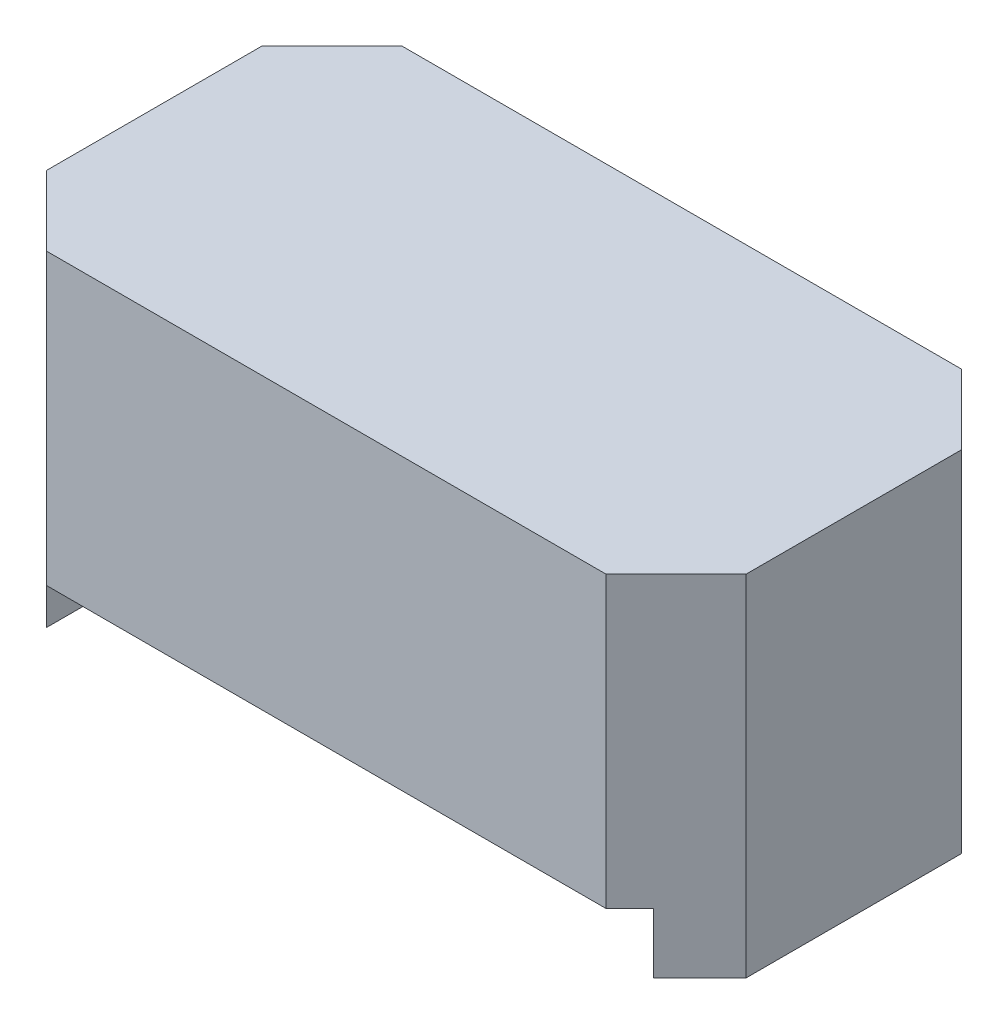
ISO-10303-21;
HEADER;
FILE_DESCRIPTION(('STEP AP214'),'2;1');
FILE_NAME('part.step','',(''),(''),'','','');
FILE_SCHEMA(('AUTOMOTIVE_DESIGN { 1 0 10303 214 1 1 1 1 }'));
ENDSEC;
DATA;
#1=APPLICATION_CONTEXT('core data for automotive mechanical design processes');
#2=APPLICATION_PROTOCOL_DEFINITION('international standard','automotive_design',2000,#1);
#3=PRODUCT_CONTEXT('',#1,'mechanical');
#4=PRODUCT('Part','Part','',(#3));
#5=PRODUCT_RELATED_PRODUCT_CATEGORY('part','',(#4));
#6=PRODUCT_DEFINITION_FORMATION('','',#4);
#7=PRODUCT_DEFINITION_CONTEXT('part definition',#1,'design');
#8=PRODUCT_DEFINITION('design','',#6,#7);
#9=PRODUCT_DEFINITION_SHAPE('','',#8);
#10=(LENGTH_UNIT() NAMED_UNIT(*) SI_UNIT(.MILLI.,.METRE.));
#11=(NAMED_UNIT(*) PLANE_ANGLE_UNIT() SI_UNIT($,.RADIAN.));
#12=(NAMED_UNIT(*) SI_UNIT($,.STERADIAN.) SOLID_ANGLE_UNIT());
#13=UNCERTAINTY_MEASURE_WITH_UNIT(LENGTH_MEASURE(1.E-05),#10,'distance_accuracy_value','');
#14=(GEOMETRIC_REPRESENTATION_CONTEXT(3) GLOBAL_UNCERTAINTY_ASSIGNED_CONTEXT((#13)) GLOBAL_UNIT_ASSIGNED_CONTEXT((#10,
#11,#12)) REPRESENTATION_CONTEXT('',''));
#15=CARTESIAN_POINT('',(0.,0.,0.));
#16=DIRECTION('',(0.,0.,1.));
#17=DIRECTION('',(1.,0.,0.));
#18=AXIS2_PLACEMENT_3D('',#15,#16,#17);
#19=CARTESIAN_POINT('',(0.,0.,0.));
#20=DIRECTION('',(0.,1.,0.));
#21=DIRECTION('',(0.,0.,1.));
#22=AXIS2_PLACEMENT_3D('',#19,#20,#21);
#23=PLANE('',#22);
#24=DIRECTION('',(0.,0.,1.));
#25=VECTOR('',#24,1.);
#26=CARTESIAN_POINT('',(-0.939961560158189,0.,-3.5));
#27=LINE('',#26,#25);
#28=CARTESIAN_POINT('',(-0.939961560158189,0.,-2.37003843984181));
#29=VERTEX_POINT('',#28);
#30=CARTESIAN_POINT('',(-0.939961560158189,0.,-0.169961560158188));
#31=VERTEX_POINT('',#30);
#32=EDGE_CURVE('E125',#29,#31,#27,.T.);
#33=ORIENTED_EDGE('',*,*,#32,.T.);
#34=DIRECTION('',(0.707106781186547,0.,0.707106781186548));
#35=VECTOR('',#34,1.);
#36=CARTESIAN_POINT('',(-1.27,0.,-0.500000000000001));
#37=LINE('',#36,#35);
#38=CARTESIAN_POINT('',(-1.27,0.,-0.5));
#39=VERTEX_POINT('',#38);
#40=EDGE_CURVE('E115',#39,#31,#37,.T.);
#41=ORIENTED_EDGE('',*,*,#40,.F.);
#42=DIRECTION('',(0.,0.,1.));
#43=VECTOR('',#42,1.);
#44=CARTESIAN_POINT('',(-1.27,0.,0.));
#45=LINE('',#44,#43);
#46=CARTESIAN_POINT('',(-1.27,0.,-2.04));
#47=VERTEX_POINT('',#46);
#48=EDGE_CURVE('E19',#47,#39,#45,.T.);
#49=ORIENTED_EDGE('',*,*,#48,.F.);
#50=DIRECTION('',(-0.707106781186548,0.,0.707106781186547));
#51=VECTOR('',#50,1.);
#52=CARTESIAN_POINT('',(-0.939961560158189,0.,-2.37003843984181));
#53=LINE('',#52,#51);
#54=EDGE_CURVE('E101',#29,#47,#53,.T.);
#55=ORIENTED_EDGE('',*,*,#54,.F.);
#56=EDGE_LOOP('',(#33,#41,#49,#55));
#57=FACE_BOUND('',#56,.T.);
#58=ADVANCED_FACE('F16',(#57),#23,.F.);
#59=CARTESIAN_POINT('',(0.,0.,0.));
#60=DIRECTION('',(0.,1.,0.));
#61=DIRECTION('',(0.,0.,1.));
#62=AXIS2_PLACEMENT_3D('',#59,#60,#61);
#63=PLANE('',#62);
#64=DIRECTION('',(0.,0.,1.));
#65=VECTOR('',#64,1.);
#66=CARTESIAN_POINT('',(3.39996156015819,0.,-3.5));
#67=LINE('',#66,#65);
#68=CARTESIAN_POINT('',(3.39996156015819,0.,-0.169961560158188));
#69=VERTEX_POINT('',#68);
#70=CARTESIAN_POINT('',(3.39996156015819,0.,-2.37003843984181));
#71=VERTEX_POINT('',#70);
#72=EDGE_CURVE('E141',#69,#71,#67,.F.);
#73=ORIENTED_EDGE('',*,*,#72,.T.);
#74=DIRECTION('',(-0.707106781186547,0.,-0.707106781186547));
#75=VECTOR('',#74,1.);
#76=CARTESIAN_POINT('',(3.73,0.,-2.04));
#77=LINE('',#76,#75);
#78=CARTESIAN_POINT('',(3.73,0.,-2.04));
#79=VERTEX_POINT('',#78);
#80=EDGE_CURVE('E127',#79,#71,#77,.T.);
#81=ORIENTED_EDGE('',*,*,#80,.F.);
#82=DIRECTION('',(0.,0.,1.));
#83=VECTOR('',#82,1.);
#84=CARTESIAN_POINT('',(3.73,0.,0.));
#85=LINE('',#84,#83);
#86=CARTESIAN_POINT('',(3.73,0.,-0.500000000000001));
#87=VERTEX_POINT('',#86);
#88=EDGE_CURVE('E135',#79,#87,#85,.T.);
#89=ORIENTED_EDGE('',*,*,#88,.T.);
#90=DIRECTION('',(0.707106781186549,0.,-0.707106781186546));
#91=VECTOR('',#90,1.);
#92=CARTESIAN_POINT('',(3.39996156015819,0.,-0.169961560158188));
#93=LINE('',#92,#91);
#94=EDGE_CURVE('E131',#69,#87,#93,.T.);
#95=ORIENTED_EDGE('',*,*,#94,.F.);
#96=EDGE_LOOP('',(#73,#81,#89,#95));
#97=FACE_BOUND('',#96,.T.);
#98=ADVANCED_FACE('F227',(#97),#63,.F.);
#99=CARTESIAN_POINT('',(3.73,2.5,0.));
#100=DIRECTION('',(-1.,0.,0.));
#101=DIRECTION('',(0.,0.,1.));
#102=AXIS2_PLACEMENT_3D('',#99,#100,#101);
#103=PLANE('',#102);
#104=DIRECTION('',(0.,1.,0.));
#105=VECTOR('',#104,1.);
#106=CARTESIAN_POINT('',(3.73,2.5,-2.04));
#107=LINE('',#106,#105);
#108=CARTESIAN_POINT('',(3.73,2.5,-2.04));
#109=VERTEX_POINT('',#108);
#110=EDGE_CURVE('E151',#79,#109,#107,.T.);
#111=ORIENTED_EDGE('',*,*,#110,.T.);
#112=DIRECTION('',(0.,0.,1.));
#113=VECTOR('',#112,1.);
#114=CARTESIAN_POINT('',(3.73,2.5,0.));
#115=LINE('',#114,#113);
#116=CARTESIAN_POINT('',(3.73,2.5,-0.500000000000001));
#117=VERTEX_POINT('',#116);
#118=EDGE_CURVE('E133',#117,#109,#115,.F.);
#119=ORIENTED_EDGE('',*,*,#118,.F.);
#120=DIRECTION('',(0.,1.,0.));
#121=VECTOR('',#120,1.);
#122=CARTESIAN_POINT('',(3.73,2.5,-0.500000000000001));
#123=LINE('',#122,#121);
#124=EDGE_CURVE('E160',#117,#87,#123,.F.);
#125=ORIENTED_EDGE('',*,*,#124,.T.);
#126=ORIENTED_EDGE('',*,*,#88,.F.);
#127=EDGE_LOOP('',(#111,#119,#125,#126));
#128=FACE_BOUND('',#127,.T.);
#129=ADVANCED_FACE('F220',(#128),#103,.F.);
#130=CARTESIAN_POINT('',(-0.939961560158189,-0.767799621488547,-3.5));
#131=DIRECTION('',(-1.,0.,0.));
#132=DIRECTION('',(0.,0.,1.));
#133=AXIS2_PLACEMENT_3D('',#130,#131,#132);
#134=PLANE('',#133);
#135=DIRECTION('',(0.,0.,1.));
#136=VECTOR('',#135,1.);
#137=CARTESIAN_POINT('',(-0.939961560158189,0.429778984675444,-3.5));
#138=LINE('',#137,#136);
#139=CARTESIAN_POINT('',(-0.939961560158189,0.429778984675444,-2.37003843984181));
#140=VERTEX_POINT('',#139);
#141=CARTESIAN_POINT('',(-0.939961560158189,0.429778984675444,-0.169961560158189));
#142=VERTEX_POINT('',#141);
#143=EDGE_CURVE('E165',#140,#142,#138,.T.);
#144=ORIENTED_EDGE('',*,*,#143,.T.);
#145=DIRECTION('',(0.,1.,0.));
#146=VECTOR('',#145,1.);
#147=CARTESIAN_POINT('',(-0.939961560158189,-0.767799621488547,-0.169961560158188));
#148=LINE('',#147,#146);
#149=EDGE_CURVE('E139',#31,#142,#148,.T.);
#150=ORIENTED_EDGE('',*,*,#149,.F.);
#151=ORIENTED_EDGE('',*,*,#32,.F.);
#152=DIRECTION('',(0.,1.,0.));
#153=VECTOR('',#152,1.);
#154=CARTESIAN_POINT('',(-0.939961560158189,2.5,-2.37003843984181));
#155=LINE('',#154,#153);
#156=EDGE_CURVE('E149',#29,#140,#155,.T.);
#157=ORIENTED_EDGE('',*,*,#156,.T.);
#158=EDGE_LOOP('',(#144,#150,#151,#157));
#159=FACE_BOUND('',#158,.T.);
#160=ADVANCED_FACE('F212',(#159),#134,.F.);
#161=CARTESIAN_POINT('',(3.39996156015818,-0.767799621488547,-3.5));
#162=DIRECTION('',(1.,0.,0.));
#163=DIRECTION('',(0.,1.,0.));
#164=AXIS2_PLACEMENT_3D('',#161,#162,#163);
#165=PLANE('',#164);
#166=ORIENTED_EDGE('',*,*,#72,.F.);
#167=DIRECTION('',(0.,1.,0.));
#168=VECTOR('',#167,1.);
#169=CARTESIAN_POINT('',(3.39996156015819,2.5,-0.169961560158187));
#170=LINE('',#169,#168);
#171=CARTESIAN_POINT('',(3.39996156015819,0.429778984675444,-0.169961560158188));
#172=VERTEX_POINT('',#171);
#173=EDGE_CURVE('E163',#69,#172,#170,.T.);
#174=ORIENTED_EDGE('',*,*,#173,.T.);
#175=DIRECTION('',(0.,0.,1.));
#176=VECTOR('',#175,1.);
#177=CARTESIAN_POINT('',(3.39996156015818,0.429778984675444,-3.5));
#178=LINE('',#177,#176);
#179=CARTESIAN_POINT('',(3.39996156015819,0.429778984675444,-2.37003843984181));
#180=VERTEX_POINT('',#179);
#181=EDGE_CURVE('E171',#172,#180,#178,.F.);
#182=ORIENTED_EDGE('',*,*,#181,.T.);
#183=DIRECTION('',(0.,1.,0.));
#184=VECTOR('',#183,1.);
#185=CARTESIAN_POINT('',(3.39996156015819,2.5,-2.37003843984182));
#186=LINE('',#185,#184);
#187=EDGE_CURVE('E156',#180,#71,#186,.F.);
#188=ORIENTED_EDGE('',*,*,#187,.T.);
#189=EDGE_LOOP('',(#166,#174,#182,#188));
#190=FACE_BOUND('',#189,.T.);
#191=ADVANCED_FACE('F234',(#190),#165,.F.);
#192=CARTESIAN_POINT('',(-1.27,2.5,0.));
#193=DIRECTION('',(1.,0.,0.));
#194=DIRECTION('',(0.,0.,-1.));
#195=AXIS2_PLACEMENT_3D('',#192,#193,#194);
#196=PLANE('',#195);
#197=DIRECTION('',(0.,1.,0.));
#198=VECTOR('',#197,1.);
#199=CARTESIAN_POINT('',(-1.27,2.5,-2.04));
#200=LINE('',#199,#198);
#201=CARTESIAN_POINT('',(-1.27,2.5,-2.04));
#202=VERTEX_POINT('',#201);
#203=EDGE_CURVE('E112',#202,#47,#200,.F.);
#204=ORIENTED_EDGE('',*,*,#203,.T.);
#205=ORIENTED_EDGE('',*,*,#48,.T.);
#206=DIRECTION('',(0.,1.,0.));
#207=VECTOR('',#206,1.);
#208=CARTESIAN_POINT('',(-1.27,2.5,-0.500000000000001));
#209=LINE('',#208,#207);
#210=CARTESIAN_POINT('',(-1.27,2.5,-0.5));
#211=VERTEX_POINT('',#210);
#212=EDGE_CURVE('E110',#39,#211,#209,.T.);
#213=ORIENTED_EDGE('',*,*,#212,.T.);
#214=DIRECTION('',(0.,0.,-1.));
#215=VECTOR('',#214,1.);
#216=CARTESIAN_POINT('',(-1.27,2.5,0.));
#217=LINE('',#216,#215);
#218=EDGE_CURVE('E144',#202,#211,#217,.F.);
#219=ORIENTED_EDGE('',*,*,#218,.F.);
#220=EDGE_LOOP('',(#204,#205,#213,#219));
#221=FACE_BOUND('',#220,.T.);
#222=ADVANCED_FACE('F108',(#221),#196,.F.);
#223=CARTESIAN_POINT('',(-1.27,2.5,-2.04));
#224=DIRECTION('',(0.707106781186546,0.,0.707106781186549));
#225=DIRECTION('',(0.707106781186549,0.,-0.707106781186546));
#226=AXIS2_PLACEMENT_3D('',#223,#224,#225);
#227=PLANE('',#226);
#228=ORIENTED_EDGE('',*,*,#54,.T.);
#229=ORIENTED_EDGE('',*,*,#203,.F.);
#230=DIRECTION('',(0.707106781186549,0.,-0.707106781186546));
#231=VECTOR('',#230,1.);
#232=CARTESIAN_POINT('',(-1.27,2.5,-2.04));
#233=LINE('',#232,#231);
#234=CARTESIAN_POINT('',(-0.769999999999997,2.5,-2.54));
#235=VERTEX_POINT('',#234);
#236=EDGE_CURVE('E146',#235,#202,#233,.F.);
#237=ORIENTED_EDGE('',*,*,#236,.F.);
#238=DIRECTION('',(0.,1.,0.));
#239=VECTOR('',#238,1.);
#240=CARTESIAN_POINT('',(-0.769999999999996,2.5,-2.54));
#241=LINE('',#240,#239);
#242=CARTESIAN_POINT('',(-0.769999999999997,0.429778984675444,-2.54));
#243=VERTEX_POINT('',#242);
#244=EDGE_CURVE('E181',#235,#243,#241,.F.);
#245=ORIENTED_EDGE('',*,*,#244,.T.);
#246=DIRECTION('',(-0.70710678118655,0.,0.707106781186545));
#247=VECTOR('',#246,1.);
#248=CARTESIAN_POINT('',(-0.769999999999998,0.429778984675444,-2.54));
#249=LINE('',#248,#247);
#250=EDGE_CURVE('E122',#243,#140,#249,.T.);
#251=ORIENTED_EDGE('',*,*,#250,.T.);
#252=ORIENTED_EDGE('',*,*,#156,.F.);
#253=EDGE_LOOP('',(#228,#229,#237,#245,#251,#252));
#254=FACE_BOUND('',#253,.T.);
#255=ADVANCED_FACE('F206',(#254),#227,.F.);
#256=CARTESIAN_POINT('',(3.23,2.5,-2.54));
#257=DIRECTION('',(-0.707106781186548,0.,0.707106781186547));
#258=DIRECTION('',(0.707106781186547,0.,0.707106781186548));
#259=AXIS2_PLACEMENT_3D('',#256,#257,#258);
#260=PLANE('',#259);
#261=DIRECTION('',(-0.707106781186545,0.,-0.70710678118655));
#262=VECTOR('',#261,1.);
#263=CARTESIAN_POINT('',(3.39996156015818,0.429778984675444,-2.37003843984181));
#264=LINE('',#263,#262);
#265=CARTESIAN_POINT('',(3.23,0.429778984675444,-2.54));
#266=VERTEX_POINT('',#265);
#267=EDGE_CURVE('E173',#180,#266,#264,.T.);
#268=ORIENTED_EDGE('',*,*,#267,.T.);
#269=DIRECTION('',(0.,1.,0.));
#270=VECTOR('',#269,1.);
#271=CARTESIAN_POINT('',(3.23,2.5,-2.54));
#272=LINE('',#271,#270);
#273=CARTESIAN_POINT('',(3.23,2.5,-2.54));
#274=VERTEX_POINT('',#273);
#275=EDGE_CURVE('E186',#266,#274,#272,.T.);
#276=ORIENTED_EDGE('',*,*,#275,.T.);
#277=DIRECTION('',(0.707106781186547,0.,0.707106781186548));
#278=VECTOR('',#277,1.);
#279=CARTESIAN_POINT('',(3.23,2.5,-2.54));
#280=LINE('',#279,#278);
#281=EDGE_CURVE('E154',#109,#274,#280,.F.);
#282=ORIENTED_EDGE('',*,*,#281,.F.);
#283=ORIENTED_EDGE('',*,*,#110,.F.);
#284=ORIENTED_EDGE('',*,*,#80,.T.);
#285=ORIENTED_EDGE('',*,*,#187,.F.);
#286=EDGE_LOOP('',(#268,#276,#282,#283,#284,#285));
#287=FACE_BOUND('',#286,.T.);
#288=ADVANCED_FACE('F229',(#287),#260,.F.);
#289=CARTESIAN_POINT('',(3.73,2.5,-0.500000000000001));
#290=DIRECTION('',(-0.707106781186546,0.,-0.707106781186549));
#291=DIRECTION('',(-0.707106781186549,0.,0.707106781186546));
#292=AXIS2_PLACEMENT_3D('',#289,#290,#291);
#293=PLANE('',#292);
#294=ORIENTED_EDGE('',*,*,#94,.T.);
#295=ORIENTED_EDGE('',*,*,#124,.F.);
#296=DIRECTION('',(-0.707106781186549,0.,0.707106781186546));
#297=VECTOR('',#296,1.);
#298=CARTESIAN_POINT('',(3.73,2.5,-0.500000000000001));
#299=LINE('',#298,#297);
#300=CARTESIAN_POINT('',(3.23,2.5,0.));
#301=VERTEX_POINT('',#300);
#302=EDGE_CURVE('E34',#301,#117,#299,.F.);
#303=ORIENTED_EDGE('',*,*,#302,.F.);
#304=DIRECTION('',(0.,1.,0.));
#305=VECTOR('',#304,1.);
#306=CARTESIAN_POINT('',(3.23,2.5,0.));
#307=LINE('',#306,#305);
#308=CARTESIAN_POINT('',(3.23,0.429778984675444,0.));
#309=VERTEX_POINT('',#308);
#310=EDGE_CURVE('E189',#301,#309,#307,.F.);
#311=ORIENTED_EDGE('',*,*,#310,.T.);
#312=DIRECTION('',(0.707106781186547,0.,-0.707106781186548));
#313=VECTOR('',#312,1.);
#314=CARTESIAN_POINT('',(3.23,0.429778984675444,0.));
#315=LINE('',#314,#313);
#316=EDGE_CURVE('E168',#309,#172,#315,.T.);
#317=ORIENTED_EDGE('',*,*,#316,.T.);
#318=ORIENTED_EDGE('',*,*,#173,.F.);
#319=EDGE_LOOP('',(#294,#295,#303,#311,#317,#318));
#320=FACE_BOUND('',#319,.T.);
#321=ADVANCED_FACE('F223',(#320),#293,.F.);
#322=CARTESIAN_POINT('',(-0.939961560158189,0.429778984675444,-3.5));
#323=DIRECTION('',(0.,1.,0.));
#324=DIRECTION('',(0.,0.,1.));
#325=AXIS2_PLACEMENT_3D('',#322,#323,#324);
#326=PLANE('',#325);
#327=DIRECTION('',(1.,0.,0.));
#328=VECTOR('',#327,1.);
#329=CARTESIAN_POINT('',(3.73,0.429778984675444,-2.54));
#330=LINE('',#329,#328);
#331=EDGE_CURVE('E183',#243,#266,#330,.T.);
#332=ORIENTED_EDGE('',*,*,#331,.T.);
#333=ORIENTED_EDGE('',*,*,#267,.F.);
#334=ORIENTED_EDGE('',*,*,#181,.F.);
#335=ORIENTED_EDGE('',*,*,#316,.F.);
#336=DIRECTION('',(-1.,0.,0.));
#337=VECTOR('',#336,1.);
#338=CARTESIAN_POINT('',(3.73,0.429778984675444,0.));
#339=LINE('',#338,#337);
#340=CARTESIAN_POINT('',(-0.770000000000001,0.429778984675444,0.));
#341=VERTEX_POINT('',#340);
#342=EDGE_CURVE('E191',#309,#341,#339,.T.);
#343=ORIENTED_EDGE('',*,*,#342,.T.);
#344=DIRECTION('',(-0.707106781186547,0.,-0.707106781186548));
#345=VECTOR('',#344,1.);
#346=CARTESIAN_POINT('',(-0.770000000000001,0.429778984675444,0.));
#347=LINE('',#346,#345);
#348=EDGE_CURVE('E178',#341,#142,#347,.T.);
#349=ORIENTED_EDGE('',*,*,#348,.T.);
#350=ORIENTED_EDGE('',*,*,#143,.F.);
#351=ORIENTED_EDGE('',*,*,#250,.F.);
#352=EDGE_LOOP('',(#332,#333,#334,#335,#343,#349,#350,#351));
#353=FACE_BOUND('',#352,.T.);
#354=ADVANCED_FACE('F209',(#353),#326,.F.);
#355=CARTESIAN_POINT('',(-0.770000000000001,2.5,0.));
#356=DIRECTION('',(0.707106781186548,0.,-0.707106781186547));
#357=DIRECTION('',(-0.707106781186547,0.,-0.707106781186548));
#358=AXIS2_PLACEMENT_3D('',#355,#356,#357);
#359=PLANE('',#358);
#360=ORIENTED_EDGE('',*,*,#348,.F.);
#361=DIRECTION('',(0.,1.,0.));
#362=VECTOR('',#361,1.);
#363=CARTESIAN_POINT('',(-0.77,2.5,0.));
#364=LINE('',#363,#362);
#365=CARTESIAN_POINT('',(-0.770000000000001,2.5,0.));
#366=VERTEX_POINT('',#365);
#367=EDGE_CURVE('E193',#341,#366,#364,.T.);
#368=ORIENTED_EDGE('',*,*,#367,.T.);
#369=DIRECTION('',(-0.707106781186547,0.,-0.707106781186548));
#370=VECTOR('',#369,1.);
#371=CARTESIAN_POINT('',(-0.770000000000001,2.5,0.));
#372=LINE('',#371,#370);
#373=EDGE_CURVE('E121',#211,#366,#372,.F.);
#374=ORIENTED_EDGE('',*,*,#373,.F.);
#375=ORIENTED_EDGE('',*,*,#212,.F.);
#376=ORIENTED_EDGE('',*,*,#40,.T.);
#377=ORIENTED_EDGE('',*,*,#149,.T.);
#378=EDGE_LOOP('',(#360,#368,#374,#375,#376,#377));
#379=FACE_BOUND('',#378,.T.);
#380=ADVANCED_FACE('F118',(#379),#359,.F.);
#381=CARTESIAN_POINT('',(3.73,2.5,-2.54));
#382=DIRECTION('',(0.,0.,1.));
#383=DIRECTION('',(1.,0.,0.));
#384=AXIS2_PLACEMENT_3D('',#381,#382,#383);
#385=PLANE('',#384);
#386=ORIENTED_EDGE('',*,*,#331,.F.);
#387=ORIENTED_EDGE('',*,*,#244,.F.);
#388=DIRECTION('',(1.,0.,0.));
#389=VECTOR('',#388,1.);
#390=CARTESIAN_POINT('',(0.,2.5,-2.54));
#391=LINE('',#390,#389);
#392=EDGE_CURVE('E25',#274,#235,#391,.F.);
#393=ORIENTED_EDGE('',*,*,#392,.F.);
#394=ORIENTED_EDGE('',*,*,#275,.F.);
#395=EDGE_LOOP('',(#386,#387,#393,#394));
#396=FACE_BOUND('',#395,.T.);
#397=ADVANCED_FACE('F204',(#396),#385,.F.);
#398=CARTESIAN_POINT('',(3.73,2.5,0.));
#399=DIRECTION('',(0.,0.,-1.));
#400=DIRECTION('',(-1.,0.,0.));
#401=AXIS2_PLACEMENT_3D('',#398,#399,#400);
#402=PLANE('',#401);
#403=ORIENTED_EDGE('',*,*,#342,.F.);
#404=ORIENTED_EDGE('',*,*,#310,.F.);
#405=DIRECTION('',(1.,0.,0.));
#406=VECTOR('',#405,1.);
#407=CARTESIAN_POINT('',(0.,2.5,0.));
#408=LINE('',#407,#406);
#409=EDGE_CURVE('E11',#366,#301,#408,.T.);
#410=ORIENTED_EDGE('',*,*,#409,.F.);
#411=ORIENTED_EDGE('',*,*,#367,.F.);
#412=EDGE_LOOP('',(#403,#404,#410,#411));
#413=FACE_BOUND('',#412,.T.);
#414=ADVANCED_FACE('F217',(#413),#402,.F.);
#415=CARTESIAN_POINT('',(0.,2.5,0.));
#416=DIRECTION('',(0.,1.,0.));
#417=DIRECTION('',(0.,0.,1.));
#418=AXIS2_PLACEMENT_3D('',#415,#416,#417);
#419=PLANE('',#418);
#420=ORIENTED_EDGE('',*,*,#118,.T.);
#421=ORIENTED_EDGE('',*,*,#281,.T.);
#422=ORIENTED_EDGE('',*,*,#392,.T.);
#423=ORIENTED_EDGE('',*,*,#236,.T.);
#424=ORIENTED_EDGE('',*,*,#218,.T.);
#425=ORIENTED_EDGE('',*,*,#373,.T.);
#426=ORIENTED_EDGE('',*,*,#409,.T.);
#427=ORIENTED_EDGE('',*,*,#302,.T.);
#428=EDGE_LOOP('',(#420,#421,#422,#423,#424,#425,#426,#427));
#429=FACE_BOUND('',#428,.T.);
#430=ADVANCED_FACE('F198',(#429),#419,.T.);
#431=CLOSED_SHELL('',(#58,#98,#129,#160,#191,#222,#255,#288,#321,#354,#380,#397,#414,#430));
#432=MANIFOLD_SOLID_BREP('B1',#431);
#433=ADVANCED_BREP_SHAPE_REPRESENTATION('',(#18,#432),#14);
#434=SHAPE_DEFINITION_REPRESENTATION(#9,#433);
ENDSEC;
END-ISO-10303-21;
